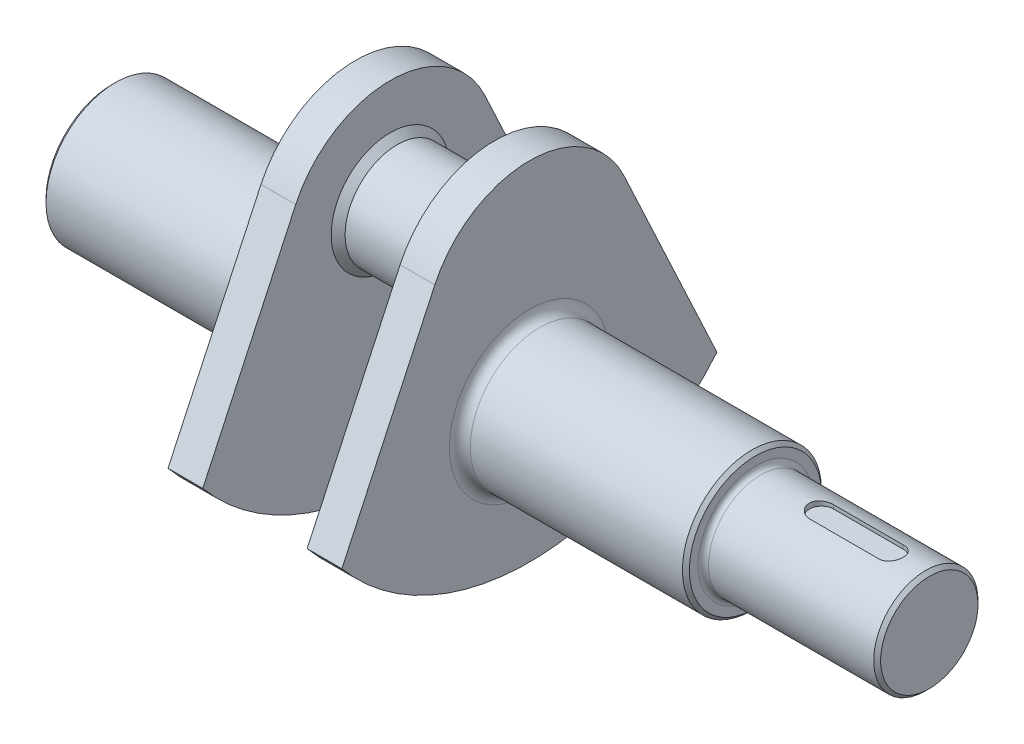
ISO-10303-21;
HEADER;
FILE_DESCRIPTION(('STEP AP214'),'2;1');
FILE_NAME('part.step','',(''),(''),'','','');
FILE_SCHEMA(('AUTOMOTIVE_DESIGN { 1 0 10303 214 1 1 1 1 }'));
ENDSEC;
DATA;
#1=APPLICATION_CONTEXT('core data for automotive mechanical design processes');
#2=APPLICATION_PROTOCOL_DEFINITION('international standard','automotive_design',2000,#1);
#3=PRODUCT_CONTEXT('',#1,'mechanical');
#4=PRODUCT('Part','Part','',(#3));
#5=PRODUCT_RELATED_PRODUCT_CATEGORY('part','',(#4));
#6=PRODUCT_DEFINITION_FORMATION('','',#4);
#7=PRODUCT_DEFINITION_CONTEXT('part definition',#1,'design');
#8=PRODUCT_DEFINITION('design','',#6,#7);
#9=PRODUCT_DEFINITION_SHAPE('','',#8);
#10=(LENGTH_UNIT() NAMED_UNIT(*) SI_UNIT(.MILLI.,.METRE.));
#11=(NAMED_UNIT(*) PLANE_ANGLE_UNIT() SI_UNIT($,.RADIAN.));
#12=(NAMED_UNIT(*) SI_UNIT($,.STERADIAN.) SOLID_ANGLE_UNIT());
#13=UNCERTAINTY_MEASURE_WITH_UNIT(LENGTH_MEASURE(1.E-05),#10,'distance_accuracy_value','');
#14=(GEOMETRIC_REPRESENTATION_CONTEXT(3) GLOBAL_UNCERTAINTY_ASSIGNED_CONTEXT((#13)) GLOBAL_UNIT_ASSIGNED_CONTEXT((#10,
#11,#12)) REPRESENTATION_CONTEXT('',''));
#15=CARTESIAN_POINT('',(0.,0.,0.));
#16=DIRECTION('',(0.,0.,1.));
#17=DIRECTION('',(1.,0.,0.));
#18=AXIS2_PLACEMENT_3D('',#15,#16,#17);
#19=CARTESIAN_POINT('',(190.,0.,0.));
#20=DIRECTION('',(1.,0.,0.));
#21=DIRECTION('',(0.,0.,1.));
#22=AXIS2_PLACEMENT_3D('',#19,#20,#21);
#23=CYLINDRICAL_SURFACE('',#22,20.);
#24=CARTESIAN_POINT('',(184.,0.,0.));
#25=DIRECTION('',(1.,0.,0.));
#26=DIRECTION('',(0.,0.,-1.));
#27=AXIS2_PLACEMENT_3D('',#24,#25,#26);
#28=CIRCLE('',#27,20.);
#29=CARTESIAN_POINT('',(184.,0.,-20.));
#30=VERTEX_POINT('',#29);
#31=EDGE_CURVE('E319',#30,#30,#28,.F.);
#32=ORIENTED_EDGE('',*,*,#31,.T.);
#33=EDGE_LOOP('',(#32));
#34=FACE_BOUND('',#33,.T.);
#35=CARTESIAN_POINT('',(123.,0.,0.));
#36=DIRECTION('',(-1.,0.,0.));
#37=DIRECTION('',(0.,0.,1.));
#38=AXIS2_PLACEMENT_3D('',#35,#36,#37);
#39=CIRCLE('',#38,20.);
#40=CARTESIAN_POINT('',(123.,0.,20.));
#41=VERTEX_POINT('',#40);
#42=EDGE_CURVE('E220',#41,#41,#39,.T.);
#43=ORIENTED_EDGE('',*,*,#42,.F.);
#44=EDGE_LOOP('',(#43));
#45=FACE_BOUND('',#44,.T.);
#46=ADVANCED_FACE('F45',(#34,#45),#23,.T.);
#47=CARTESIAN_POINT('',(110.,0.,0.));
#48=DIRECTION('',(-1.,0.,0.));
#49=DIRECTION('',(0.,0.,-1.));
#50=AXIS2_PLACEMENT_3D('',#47,#48,#49);
#51=PLANE('',#50);
#52=CARTESIAN_POINT('',(110.,30.,0.));
#53=DIRECTION('',(-1.,0.,0.));
#54=DIRECTION('',(0.,0.,1.));
#55=AXIS2_PLACEMENT_3D('',#52,#53,#54);
#56=CIRCLE('',#55,17.);
#57=CARTESIAN_POINT('',(110.,30.,17.));
#58=VERTEX_POINT('',#57);
#59=EDGE_CURVE('E283',#58,#58,#56,.F.);
#60=ORIENTED_EDGE('',*,*,#59,.T.);
#61=EDGE_LOOP('',(#60));
#62=FACE_BOUND('',#61,.T.);
#63=DIRECTION('',(0.,0.90630778703665,-0.4226182617407));
#64=VECTOR('',#63,1.);
#65=CARTESIAN_POINT('',(110.,18.0367337069229,38.6799002578842));
#66=LINE('',#65,#64);
#67=CARTESIAN_POINT('',(110.,-14.6413895114318,53.9179593687357));
#68=VERTEX_POINT('',#67);
#69=CARTESIAN_POINT('',(110.,42.678547852221,27.1892336110995));
#70=VERTEX_POINT('',#69);
#71=EDGE_CURVE('E186',#68,#70,#66,.T.);
#72=ORIENTED_EDGE('',*,*,#71,.T.);
#73=CARTESIAN_POINT('',(110.,30.,0.));
#74=DIRECTION('',(1.,0.,0.));
#75=DIRECTION('',(0.,0.,-1.));
#76=AXIS2_PLACEMENT_3D('',#73,#74,#75);
#77=CIRCLE('',#76,30.);
#78=CARTESIAN_POINT('',(110.,42.678547852221,-27.1892336110995));
#79=VERTEX_POINT('',#78);
#80=EDGE_CURVE('E176',#79,#70,#77,.T.);
#81=ORIENTED_EDGE('',*,*,#80,.F.);
#82=DIRECTION('',(0.,0.90630778703665,0.4226182617407));
#83=VECTOR('',#82,1.);
#84=CARTESIAN_POINT('',(110.,18.0367337069229,-38.6799002578842));
#85=LINE('',#84,#83);
#86=CARTESIAN_POINT('',(110.,-14.6413895114318,-53.9179593687357));
#87=VERTEX_POINT('',#86);
#88=EDGE_CURVE('E179',#87,#79,#85,.T.);
#89=ORIENTED_EDGE('',*,*,#88,.F.);
#90=CARTESIAN_POINT('',(110.,30.,0.));
#91=DIRECTION('',(1.,0.,0.));
#92=DIRECTION('',(0.,0.,-1.));
#93=AXIS2_PLACEMENT_3D('',#90,#91,#92);
#94=CIRCLE('',#93,70.);
#95=EDGE_CURVE('E183',#68,#87,#94,.T.);
#96=ORIENTED_EDGE('',*,*,#95,.F.);
#97=EDGE_LOOP('',(#72,#81,#89,#96));
#98=FACE_BOUND('',#97,.T.);
#99=ADVANCED_FACE('F367',(#62,#98),#51,.T.);
#100=CARTESIAN_POINT('',(70.,0.,0.));
#101=DIRECTION('',(-1.,0.,0.));
#102=DIRECTION('',(0.,0.,1.));
#103=AXIS2_PLACEMENT_3D('',#100,#101,#102);
#104=PLANE('',#103);
#105=CARTESIAN_POINT('',(70.,0.,0.));
#106=DIRECTION('',(-1.,0.,0.));
#107=DIRECTION('',(0.,0.,1.));
#108=AXIS2_PLACEMENT_3D('',#105,#106,#107);
#109=CIRCLE('',#108,23.);
#110=CARTESIAN_POINT('',(70.,0.,23.));
#111=VERTEX_POINT('',#110);
#112=EDGE_CURVE('E258',#111,#111,#109,.T.);
#113=ORIENTED_EDGE('',*,*,#112,.F.);
#114=EDGE_LOOP('',(#113));
#115=FACE_BOUND('',#114,.T.);
#116=DIRECTION('',(0.,0.90630778703665,-0.4226182617407));
#117=VECTOR('',#116,1.);
#118=CARTESIAN_POINT('',(70.,18.0367337069229,38.6799002578842));
#119=LINE('',#118,#117);
#120=CARTESIAN_POINT('',(70.,-14.6413895114318,53.9179593687357));
#121=VERTEX_POINT('',#120);
#122=CARTESIAN_POINT('',(70.,42.678547852221,27.1892336110995));
#123=VERTEX_POINT('',#122);
#124=EDGE_CURVE('E244',#121,#123,#119,.T.);
#125=ORIENTED_EDGE('',*,*,#124,.T.);
#126=CARTESIAN_POINT('',(70.,30.,0.));
#127=DIRECTION('',(-1.,0.,0.));
#128=DIRECTION('',(0.,0.,1.));
#129=AXIS2_PLACEMENT_3D('',#126,#127,#128);
#130=CIRCLE('',#129,30.);
#131=CARTESIAN_POINT('',(70.,42.678547852221,-27.1892336110995));
#132=VERTEX_POINT('',#131);
#133=EDGE_CURVE('E224',#123,#132,#130,.T.);
#134=ORIENTED_EDGE('',*,*,#133,.T.);
#135=DIRECTION('',(0.,0.90630778703665,0.4226182617407));
#136=VECTOR('',#135,1.);
#137=CARTESIAN_POINT('',(70.,18.0367337069229,-38.6799002578842));
#138=LINE('',#137,#136);
#139=CARTESIAN_POINT('',(70.,-14.6413895114318,-53.9179593687357));
#140=VERTEX_POINT('',#139);
#141=EDGE_CURVE('E229',#140,#132,#138,.T.);
#142=ORIENTED_EDGE('',*,*,#141,.F.);
#143=CARTESIAN_POINT('',(70.,30.,0.));
#144=DIRECTION('',(-1.,0.,0.));
#145=DIRECTION('',(0.,0.,1.));
#146=AXIS2_PLACEMENT_3D('',#143,#144,#145);
#147=CIRCLE('',#146,70.);
#148=EDGE_CURVE('E248',#140,#121,#147,.T.);
#149=ORIENTED_EDGE('',*,*,#148,.T.);
#150=EDGE_LOOP('',(#125,#134,#142,#149));
#151=FACE_BOUND('',#150,.T.);
#152=ADVANCED_FACE('F373',(#115,#151),#104,.T.);
#153=CARTESIAN_POINT('',(67.,0.,0.));
#154=DIRECTION('',(-1.,0.,0.));
#155=DIRECTION('',(0.,0.,1.));
#156=AXIS2_PLACEMENT_3D('',#153,#154,#155);
#157=TOROIDAL_SURFACE('',#156,23.,3.);
#158=ORIENTED_EDGE('',*,*,#112,.T.);
#159=EDGE_LOOP('',(#158));
#160=FACE_BOUND('',#159,.T.);
#161=CARTESIAN_POINT('',(67.,0.,0.));
#162=DIRECTION('',(-1.,0.,0.));
#163=DIRECTION('',(0.,0.,1.));
#164=AXIS2_PLACEMENT_3D('',#161,#162,#163);
#165=CIRCLE('',#164,20.);
#166=CARTESIAN_POINT('',(67.,0.,20.));
#167=VERTEX_POINT('',#166);
#168=EDGE_CURVE('E279',#167,#167,#165,.T.);
#169=ORIENTED_EDGE('',*,*,#168,.F.);
#170=EDGE_LOOP('',(#169));
#171=FACE_BOUND('',#170,.T.);
#172=ADVANCED_FACE('F410',(#160,#171),#157,.F.);
#173=CARTESIAN_POINT('',(0.,0.,0.));
#174=DIRECTION('',(-1.,0.,0.));
#175=DIRECTION('',(0.,0.,1.));
#176=AXIS2_PLACEMENT_3D('',#173,#174,#175);
#177=CYLINDRICAL_SURFACE('',#176,20.);
#178=ORIENTED_EDGE('',*,*,#168,.T.);
#179=EDGE_LOOP('',(#178));
#180=FACE_BOUND('',#179,.T.);
#181=CARTESIAN_POINT('',(1.,0.,0.));
#182=DIRECTION('',(-1.,0.,0.));
#183=DIRECTION('',(0.,0.,1.));
#184=AXIS2_PLACEMENT_3D('',#181,#182,#183);
#185=CIRCLE('',#184,20.);
#186=CARTESIAN_POINT('',(1.,0.,20.));
#187=VERTEX_POINT('',#186);
#188=EDGE_CURVE('E275',#187,#187,#185,.T.);
#189=ORIENTED_EDGE('',*,*,#188,.F.);
#190=EDGE_LOOP('',(#189));
#191=FACE_BOUND('',#190,.T.);
#192=ADVANCED_FACE('F421',(#180,#191),#177,.T.);
#193=CARTESIAN_POINT('',(0.,0.,0.));
#194=DIRECTION('',(1.,0.,0.));
#195=DIRECTION('',(0.,0.,-1.));
#196=AXIS2_PLACEMENT_3D('',#193,#194,#195);
#197=CONICAL_SURFACE('',#196,19.,0.785398163397449);
#198=ORIENTED_EDGE('',*,*,#188,.T.);
#199=EDGE_LOOP('',(#198));
#200=FACE_BOUND('',#199,.T.);
#201=CARTESIAN_POINT('',(0.,0.,0.));
#202=DIRECTION('',(-1.,0.,0.));
#203=DIRECTION('',(0.,0.,1.));
#204=AXIS2_PLACEMENT_3D('',#201,#202,#203);
#205=CIRCLE('',#204,19.);
#206=CARTESIAN_POINT('',(0.,0.,19.));
#207=VERTEX_POINT('',#206);
#208=EDGE_CURVE('E271',#207,#207,#205,.T.);
#209=ORIENTED_EDGE('',*,*,#208,.F.);
#210=EDGE_LOOP('',(#209));
#211=FACE_BOUND('',#210,.T.);
#212=ADVANCED_FACE('F417',(#200,#211),#197,.T.);
#213=CARTESIAN_POINT('',(0.,0.,0.));
#214=DIRECTION('',(-1.,0.,0.));
#215=DIRECTION('',(0.,0.,1.));
#216=AXIS2_PLACEMENT_3D('',#213,#214,#215);
#217=PLANE('',#216);
#218=ORIENTED_EDGE('',*,*,#208,.T.);
#219=EDGE_LOOP('',(#218));
#220=FACE_BOUND('',#219,.T.);
#221=ADVANCED_FACE('F406',(#220),#217,.T.);
#222=CARTESIAN_POINT('',(80.,30.,0.));
#223=DIRECTION('',(-1.,0.,0.));
#224=DIRECTION('',(0.,0.,1.));
#225=AXIS2_PLACEMENT_3D('',#222,#223,#224);
#226=CYLINDRICAL_SURFACE('',#225,30.);
#227=ORIENTED_EDGE('',*,*,#133,.F.);
#228=DIRECTION('',(-1.,0.,0.));
#229=VECTOR('',#228,1.);
#230=CARTESIAN_POINT('',(80.,42.678547852221,27.1892336110995));
#231=LINE('',#230,#229);
#232=CARTESIAN_POINT('',(80.,42.678547852221,27.1892336110995));
#233=VERTEX_POINT('',#232);
#234=EDGE_CURVE('E240',#233,#123,#231,.T.);
#235=ORIENTED_EDGE('',*,*,#234,.F.);
#236=CARTESIAN_POINT('',(80.,30.,0.));
#237=DIRECTION('',(-1.,0.,0.));
#238=DIRECTION('',(0.,0.,1.));
#239=AXIS2_PLACEMENT_3D('',#236,#237,#238);
#240=CIRCLE('',#239,30.);
#241=CARTESIAN_POINT('',(80.,42.678547852221,-27.1892336110995));
#242=VERTEX_POINT('',#241);
#243=EDGE_CURVE('E225',#233,#242,#240,.T.);
#244=ORIENTED_EDGE('',*,*,#243,.T.);
#245=DIRECTION('',(-1.,0.,0.));
#246=VECTOR('',#245,1.);
#247=CARTESIAN_POINT('',(80.,42.678547852221,-27.1892336110995));
#248=LINE('',#247,#246);
#249=EDGE_CURVE('E255',#242,#132,#248,.T.);
#250=ORIENTED_EDGE('',*,*,#249,.T.);
#251=EDGE_LOOP('',(#227,#235,#244,#250));
#252=FACE_BOUND('',#251,.T.);
#253=ADVANCED_FACE('F395',(#252),#226,.T.);
#254=CARTESIAN_POINT('',(80.,18.0367337069229,-38.6799002578842));
#255=DIRECTION('',(0.,-0.4226182617407,0.90630778703665));
#256=DIRECTION('',(0.,-0.90630778703665,-0.4226182617407));
#257=AXIS2_PLACEMENT_3D('',#254,#255,#256);
#258=PLANE('',#257);
#259=ORIENTED_EDGE('',*,*,#141,.T.);
#260=ORIENTED_EDGE('',*,*,#249,.F.);
#261=DIRECTION('',(0.,0.90630778703665,0.4226182617407));
#262=VECTOR('',#261,1.);
#263=CARTESIAN_POINT('',(80.,18.0367337069229,-38.6799002578842));
#264=LINE('',#263,#262);
#265=CARTESIAN_POINT('',(80.,-14.6413895114318,-53.9179593687357));
#266=VERTEX_POINT('',#265);
#267=EDGE_CURVE('E236',#266,#242,#264,.T.);
#268=ORIENTED_EDGE('',*,*,#267,.F.);
#269=DIRECTION('',(-1.,0.,0.));
#270=VECTOR('',#269,1.);
#271=CARTESIAN_POINT('',(80.,-14.6413895114318,-53.9179593687357));
#272=LINE('',#271,#270);
#273=EDGE_CURVE('E259',#266,#140,#272,.T.);
#274=ORIENTED_EDGE('',*,*,#273,.T.);
#275=EDGE_LOOP('',(#259,#260,#268,#274));
#276=FACE_BOUND('',#275,.T.);
#277=ADVANCED_FACE('F391',(#276),#258,.F.);
#278=CARTESIAN_POINT('',(80.,30.,0.));
#279=DIRECTION('',(-1.,0.,0.));
#280=DIRECTION('',(0.,0.,1.));
#281=AXIS2_PLACEMENT_3D('',#278,#279,#280);
#282=CYLINDRICAL_SURFACE('',#281,70.);
#283=ORIENTED_EDGE('',*,*,#148,.F.);
#284=ORIENTED_EDGE('',*,*,#273,.F.);
#285=CARTESIAN_POINT('',(80.,30.,0.));
#286=DIRECTION('',(-1.,0.,0.));
#287=DIRECTION('',(0.,0.,1.));
#288=AXIS2_PLACEMENT_3D('',#285,#286,#287);
#289=CIRCLE('',#288,70.);
#290=CARTESIAN_POINT('',(80.,-14.6413895114317,53.9179593687357));
#291=VERTEX_POINT('',#290);
#292=EDGE_CURVE('E232',#266,#291,#289,.T.);
#293=ORIENTED_EDGE('',*,*,#292,.T.);
#294=DIRECTION('',(-1.,0.,0.));
#295=VECTOR('',#294,1.);
#296=CARTESIAN_POINT('',(80.,-14.6413895114318,53.9179593687357));
#297=LINE('',#296,#295);
#298=EDGE_CURVE('E262',#291,#121,#297,.T.);
#299=ORIENTED_EDGE('',*,*,#298,.T.);
#300=EDGE_LOOP('',(#283,#284,#293,#299));
#301=FACE_BOUND('',#300,.T.);
#302=ADVANCED_FACE('F394',(#301),#282,.T.);
#303=CARTESIAN_POINT('',(80.,18.0367337069229,38.6799002578842));
#304=DIRECTION('',(0.,0.4226182617407,0.90630778703665));
#305=DIRECTION('',(0.,-0.90630778703665,0.4226182617407));
#306=AXIS2_PLACEMENT_3D('',#303,#304,#305);
#307=PLANE('',#306);
#308=ORIENTED_EDGE('',*,*,#124,.F.);
#309=ORIENTED_EDGE('',*,*,#298,.F.);
#310=DIRECTION('',(0.,0.90630778703665,-0.4226182617407));
#311=VECTOR('',#310,1.);
#312=CARTESIAN_POINT('',(80.,18.0367337069229,38.6799002578842));
#313=LINE('',#312,#311);
#314=EDGE_CURVE('E228',#291,#233,#313,.T.);
#315=ORIENTED_EDGE('',*,*,#314,.T.);
#316=ORIENTED_EDGE('',*,*,#234,.T.);
#317=EDGE_LOOP('',(#308,#309,#315,#316));
#318=FACE_BOUND('',#317,.T.);
#319=ADVANCED_FACE('F399',(#318),#307,.T.);
#320=CARTESIAN_POINT('',(80.,0.,0.));
#321=DIRECTION('',(1.,0.,0.));
#322=DIRECTION('',(0.,0.,-1.));
#323=AXIS2_PLACEMENT_3D('',#320,#321,#322);
#324=PLANE('',#323);
#325=CARTESIAN_POINT('',(80.,30.,0.));
#326=DIRECTION('',(1.,0.,0.));
#327=DIRECTION('',(0.,0.,-1.));
#328=AXIS2_PLACEMENT_3D('',#325,#326,#327);
#329=CIRCLE('',#328,16.9999999999999);
#330=CARTESIAN_POINT('',(80.,30.,-16.9999999999999));
#331=VERTEX_POINT('',#330);
#332=EDGE_CURVE('E295',#331,#331,#329,.F.);
#333=ORIENTED_EDGE('',*,*,#332,.T.);
#334=EDGE_LOOP('',(#333));
#335=FACE_BOUND('',#334,.T.);
#336=ORIENTED_EDGE('',*,*,#267,.T.);
#337=ORIENTED_EDGE('',*,*,#243,.F.);
#338=ORIENTED_EDGE('',*,*,#314,.F.);
#339=ORIENTED_EDGE('',*,*,#292,.F.);
#340=EDGE_LOOP('',(#336,#337,#338,#339));
#341=FACE_BOUND('',#340,.T.);
#342=ADVANCED_FACE('F389',(#335,#341),#324,.T.);
#343=CARTESIAN_POINT('',(110.,30.,0.));
#344=DIRECTION('',(-1.,0.,0.));
#345=DIRECTION('',(0.,0.,1.));
#346=AXIS2_PLACEMENT_3D('',#343,#344,#345);
#347=CYLINDRICAL_SURFACE('',#346,15.);
#348=CARTESIAN_POINT('',(108.,30.,0.));
#349=DIRECTION('',(-1.,0.,0.));
#350=DIRECTION('',(0.,0.,1.));
#351=AXIS2_PLACEMENT_3D('',#348,#349,#350);
#352=CIRCLE('',#351,15.);
#353=CARTESIAN_POINT('',(108.,30.,15.));
#354=VERTEX_POINT('',#353);
#355=EDGE_CURVE('E291',#354,#354,#352,.T.);
#356=ORIENTED_EDGE('',*,*,#355,.T.);
#357=EDGE_LOOP('',(#356));
#358=FACE_BOUND('',#357,.T.);
#359=CARTESIAN_POINT('',(82.,30.,0.));
#360=DIRECTION('',(1.,0.,0.));
#361=DIRECTION('',(0.,0.,-1.));
#362=AXIS2_PLACEMENT_3D('',#359,#360,#361);
#363=CIRCLE('',#362,15.);
#364=CARTESIAN_POINT('',(82.,30.,-15.));
#365=VERTEX_POINT('',#364);
#366=EDGE_CURVE('E287',#365,#365,#363,.T.);
#367=ORIENTED_EDGE('',*,*,#366,.T.);
#368=EDGE_LOOP('',(#367));
#369=FACE_BOUND('',#368,.T.);
#370=ADVANCED_FACE('F385',(#358,#369),#347,.T.);
#371=CARTESIAN_POINT('',(110.,30.,0.));
#372=DIRECTION('',(1.,0.,0.));
#373=DIRECTION('',(0.,0.,-1.));
#374=AXIS2_PLACEMENT_3D('',#371,#372,#373);
#375=CYLINDRICAL_SURFACE('',#374,30.);
#376=CARTESIAN_POINT('',(120.,30.,0.));
#377=DIRECTION('',(1.,0.,0.));
#378=DIRECTION('',(0.,0.,-1.));
#379=AXIS2_PLACEMENT_3D('',#376,#377,#378);
#380=CIRCLE('',#379,30.);
#381=CARTESIAN_POINT('',(120.,42.678547852221,-27.1892336110995));
#382=VERTEX_POINT('',#381);
#383=CARTESIAN_POINT('',(120.,42.678547852221,27.1892336110995));
#384=VERTEX_POINT('',#383);
#385=EDGE_CURVE('E169',#382,#384,#380,.T.);
#386=ORIENTED_EDGE('',*,*,#385,.F.);
#387=DIRECTION('',(1.,0.,0.));
#388=VECTOR('',#387,1.);
#389=CARTESIAN_POINT('',(110.,42.678547852221,-27.1892336110995));
#390=LINE('',#389,#388);
#391=EDGE_CURVE('E190',#79,#382,#390,.T.);
#392=ORIENTED_EDGE('',*,*,#391,.F.);
#393=ORIENTED_EDGE('',*,*,#80,.T.);
#394=DIRECTION('',(1.,0.,0.));
#395=VECTOR('',#394,1.);
#396=CARTESIAN_POINT('',(110.,42.678547852221,27.1892336110995));
#397=LINE('',#396,#395);
#398=EDGE_CURVE('E205',#70,#384,#397,.T.);
#399=ORIENTED_EDGE('',*,*,#398,.T.);
#400=EDGE_LOOP('',(#386,#392,#393,#399));
#401=FACE_BOUND('',#400,.T.);
#402=ADVANCED_FACE('F388',(#401),#375,.T.);
#403=CARTESIAN_POINT('',(110.,18.0367337069229,38.6799002578842));
#404=DIRECTION('',(0.,-0.4226182617407,-0.90630778703665));
#405=DIRECTION('',(0.,0.90630778703665,-0.4226182617407));
#406=AXIS2_PLACEMENT_3D('',#403,#404,#405);
#407=PLANE('',#406);
#408=DIRECTION('',(0.,0.90630778703665,-0.4226182617407));
#409=VECTOR('',#408,1.);
#410=CARTESIAN_POINT('',(120.,18.0367337069229,38.6799002578842));
#411=LINE('',#410,#409);
#412=CARTESIAN_POINT('',(120.,-14.6413895114318,53.9179593687357));
#413=VERTEX_POINT('',#412);
#414=EDGE_CURVE('E180',#413,#384,#411,.T.);
#415=ORIENTED_EDGE('',*,*,#414,.T.);
#416=ORIENTED_EDGE('',*,*,#398,.F.);
#417=ORIENTED_EDGE('',*,*,#71,.F.);
#418=DIRECTION('',(1.,0.,0.));
#419=VECTOR('',#418,1.);
#420=CARTESIAN_POINT('',(110.,-14.6413895114318,53.9179593687357));
#421=LINE('',#420,#419);
#422=EDGE_CURVE('E209',#68,#413,#421,.T.);
#423=ORIENTED_EDGE('',*,*,#422,.T.);
#424=EDGE_LOOP('',(#415,#416,#417,#423));
#425=FACE_BOUND('',#424,.T.);
#426=ADVANCED_FACE('F465',(#425),#407,.F.);
#427=CARTESIAN_POINT('',(110.,30.,0.));
#428=DIRECTION('',(1.,0.,0.));
#429=DIRECTION('',(0.,0.,-1.));
#430=AXIS2_PLACEMENT_3D('',#427,#428,#429);
#431=CYLINDRICAL_SURFACE('',#430,70.);
#432=CARTESIAN_POINT('',(120.,30.,0.));
#433=DIRECTION('',(1.,0.,0.));
#434=DIRECTION('',(0.,0.,-1.));
#435=AXIS2_PLACEMENT_3D('',#432,#433,#434);
#436=CIRCLE('',#435,70.);
#437=CARTESIAN_POINT('',(120.,-14.6413895114318,-53.9179593687357));
#438=VERTEX_POINT('',#437);
#439=EDGE_CURVE('E198',#413,#438,#436,.T.);
#440=ORIENTED_EDGE('',*,*,#439,.F.);
#441=ORIENTED_EDGE('',*,*,#422,.F.);
#442=ORIENTED_EDGE('',*,*,#95,.T.);
#443=DIRECTION('',(1.,0.,0.));
#444=VECTOR('',#443,1.);
#445=CARTESIAN_POINT('',(110.,-14.6413895114318,-53.9179593687357));
#446=LINE('',#445,#444);
#447=EDGE_CURVE('E70',#87,#438,#446,.T.);
#448=ORIENTED_EDGE('',*,*,#447,.T.);
#449=EDGE_LOOP('',(#440,#441,#442,#448));
#450=FACE_BOUND('',#449,.T.);
#451=ADVANCED_FACE('F468',(#450),#431,.T.);
#452=CARTESIAN_POINT('',(110.,18.0367337069229,-38.6799002578842));
#453=DIRECTION('',(0.,0.4226182617407,-0.90630778703665));
#454=DIRECTION('',(0.,0.90630778703665,0.4226182617407));
#455=AXIS2_PLACEMENT_3D('',#452,#453,#454);
#456=PLANE('',#455);
#457=DIRECTION('',(0.,0.90630778703665,0.4226182617407));
#458=VECTOR('',#457,1.);
#459=CARTESIAN_POINT('',(120.,18.0367337069229,-38.6799002578842));
#460=LINE('',#459,#458);
#461=EDGE_CURVE('E194',#438,#382,#460,.T.);
#462=ORIENTED_EDGE('',*,*,#461,.F.);
#463=ORIENTED_EDGE('',*,*,#447,.F.);
#464=ORIENTED_EDGE('',*,*,#88,.T.);
#465=ORIENTED_EDGE('',*,*,#391,.T.);
#466=EDGE_LOOP('',(#462,#463,#464,#465));
#467=FACE_BOUND('',#466,.T.);
#468=ADVANCED_FACE('F383',(#467),#456,.T.);
#469=CARTESIAN_POINT('',(123.,0.,0.));
#470=DIRECTION('',(1.,0.,0.));
#471=DIRECTION('',(0.,0.,1.));
#472=AXIS2_PLACEMENT_3D('',#469,#470,#471);
#473=TOROIDAL_SURFACE('',#472,23.,3.);
#474=CARTESIAN_POINT('',(120.,0.,0.));
#475=DIRECTION('',(-1.,0.,0.));
#476=DIRECTION('',(0.,0.,1.));
#477=AXIS2_PLACEMENT_3D('',#474,#475,#476);
#478=CIRCLE('',#477,23.);
#479=CARTESIAN_POINT('',(120.,0.,23.));
#480=VERTEX_POINT('',#479);
#481=EDGE_CURVE('E208',#480,#480,#478,.T.);
#482=ORIENTED_EDGE('',*,*,#481,.F.);
#483=EDGE_LOOP('',(#482));
#484=FACE_BOUND('',#483,.T.);
#485=ORIENTED_EDGE('',*,*,#42,.T.);
#486=EDGE_LOOP('',(#485));
#487=FACE_BOUND('',#486,.T.);
#488=ADVANCED_FACE('F379',(#484,#487),#473,.F.);
#489=CARTESIAN_POINT('',(120.,0.,0.));
#490=DIRECTION('',(1.,0.,0.));
#491=DIRECTION('',(0.,0.,1.));
#492=AXIS2_PLACEMENT_3D('',#489,#490,#491);
#493=PLANE('',#492);
#494=ORIENTED_EDGE('',*,*,#481,.T.);
#495=EDGE_LOOP('',(#494));
#496=FACE_BOUND('',#495,.T.);
#497=ORIENTED_EDGE('',*,*,#461,.T.);
#498=ORIENTED_EDGE('',*,*,#385,.T.);
#499=ORIENTED_EDGE('',*,*,#414,.F.);
#500=ORIENTED_EDGE('',*,*,#439,.T.);
#501=EDGE_LOOP('',(#497,#498,#499,#500));
#502=FACE_BOUND('',#501,.T.);
#503=ADVANCED_FACE('F382',(#496,#502),#493,.T.);
#504=CARTESIAN_POINT('',(110.,30.,0.));
#505=DIRECTION('',(1.,0.,0.));
#506=DIRECTION('',(0.,0.,-1.));
#507=AXIS2_PLACEMENT_3D('',#504,#505,#506);
#508=CONICAL_SURFACE('',#507,17.,0.785398163397452);
#509=ORIENTED_EDGE('',*,*,#355,.F.);
#510=EDGE_LOOP('',(#509));
#511=FACE_BOUND('',#510,.T.);
#512=ORIENTED_EDGE('',*,*,#59,.F.);
#513=EDGE_LOOP('',(#512));
#514=FACE_BOUND('',#513,.T.);
#515=ADVANCED_FACE('F430',(#511,#514),#508,.T.);
#516=CARTESIAN_POINT('',(82.,30.,0.));
#517=DIRECTION('',(-1.,0.,0.));
#518=DIRECTION('',(0.,0.,1.));
#519=AXIS2_PLACEMENT_3D('',#516,#517,#518);
#520=CONICAL_SURFACE('',#519,15.,0.785398163397438);
#521=ORIENTED_EDGE('',*,*,#332,.F.);
#522=EDGE_LOOP('',(#521));
#523=FACE_BOUND('',#522,.T.);
#524=ORIENTED_EDGE('',*,*,#366,.F.);
#525=EDGE_LOOP('',(#524));
#526=FACE_BOUND('',#525,.T.);
#527=ADVANCED_FACE('F436',(#523,#526),#520,.T.);
#528=CARTESIAN_POINT('',(185.,0.,0.));
#529=DIRECTION('',(1.,0.,0.));
#530=DIRECTION('',(0.,0.,-1.));
#531=AXIS2_PLACEMENT_3D('',#528,#529,#530);
#532=PLANE('',#531);
#533=CARTESIAN_POINT('',(185.,0.,0.));
#534=DIRECTION('',(1.,0.,0.));
#535=DIRECTION('',(0.,0.,-1.));
#536=AXIS2_PLACEMENT_3D('',#533,#534,#535);
#537=CIRCLE('',#536,19.);
#538=CARTESIAN_POINT('',(185.,0.,-19.));
#539=VERTEX_POINT('',#538);
#540=EDGE_CURVE('E315',#539,#539,#537,.T.);
#541=ORIENTED_EDGE('',*,*,#540,.T.);
#542=EDGE_LOOP('',(#541));
#543=FACE_BOUND('',#542,.T.);
#544=CARTESIAN_POINT('',(185.,0.,0.));
#545=DIRECTION('',(1.,0.,0.));
#546=DIRECTION('',(0.,0.,-1.));
#547=AXIS2_PLACEMENT_3D('',#544,#545,#546);
#548=CIRCLE('',#547,16.5);
#549=CARTESIAN_POINT('',(185.,0.,-16.5));
#550=VERTEX_POINT('',#549);
#551=EDGE_CURVE('E311',#550,#550,#548,.F.);
#552=ORIENTED_EDGE('',*,*,#551,.T.);
#553=EDGE_LOOP('',(#552));
#554=FACE_BOUND('',#553,.T.);
#555=ADVANCED_FACE('F364',(#543,#554),#532,.T.);
#556=CARTESIAN_POINT('',(235.,0.,0.));
#557=DIRECTION('',(-1.,0.,0.));
#558=DIRECTION('',(0.,0.,1.));
#559=AXIS2_PLACEMENT_3D('',#556,#557,#558);
#560=CYLINDRICAL_SURFACE('',#559,15.);
#561=DIRECTION('',(-1.,0.,0.));
#562=VECTOR('',#561,1.);
#563=CARTESIAN_POINT('',(235.,14.5859521458148,3.5));
#564=LINE('',#563,#562);
#565=CARTESIAN_POINT('',(224.,14.5859521458148,3.5));
#566=VERTEX_POINT('',#565);
#567=CARTESIAN_POINT('',(204.,14.5859521458148,3.5));
#568=VERTEX_POINT('',#567);
#569=EDGE_CURVE('E11',#566,#568,#564,.T.);
#570=ORIENTED_EDGE('',*,*,#569,.T.);
#571=CARTESIAN_POINT('',(204.,14.5859521458148,3.5));
#572=CARTESIAN_POINT('',(203.90299300161,14.5859421427493,3.50001098449828));
#573=CARTESIAN_POINT('',(203.805992360835,14.5869196724103,3.4959671414725));
#574=CARTESIAN_POINT('',(203.612712184711,14.590775651507,3.47985507535717));
#575=CARTESIAN_POINT('',(203.516432541902,14.5936538117244,3.46778807314716));
#576=CARTESIAN_POINT('',(203.325446071953,14.6012300751875,3.43574398529353));
#577=CARTESIAN_POINT('',(203.230736710124,14.6059248699511,3.41578127797057));
#578=CARTESIAN_POINT('',(203.043408831538,14.6169869222721,3.36812809560663));
#579=CARTESIAN_POINT('',(202.950790336207,14.6233541969602,3.3404375414115));
#580=CARTESIAN_POINT('',(202.677043905043,14.6447008951947,3.24606757093601));
#581=CARTESIAN_POINT('',(202.499847810349,14.6619327373735,3.16805985507851));
#582=CARTESIAN_POINT('',(202.16110813051,14.7004448089945,2.98423929243028));
#583=CARTESIAN_POINT('',(201.99956783575,14.7217258866924,2.87842061787579));
#584=CARTESIAN_POINT('',(201.693557552577,14.7663931109474,2.63980745312909));
#585=CARTESIAN_POINT('',(201.549427454254,14.7898090771762,2.50658184202697));
#586=CARTESIAN_POINT('',(201.28533943885,14.8358492789609,2.21786171845335));
#587=CARTESIAN_POINT('',(201.165385336529,14.8584733891041,2.0623636982024));
#588=CARTESIAN_POINT('',(200.951681332091,14.9007084250488,1.73119672453191));
#589=CARTESIAN_POINT('',(200.858264317659,14.9202797924377,1.55530745410667));
#590=CARTESIAN_POINT('',(200.70245169925,14.9538625089062,1.18980124862644));
#591=CARTESIAN_POINT('',(200.6400505368,14.9678748541492,1.00018678030166));
#592=CARTESIAN_POINT('',(200.549120378715,14.9885500433699,0.616173224991133));
#593=CARTESIAN_POINT('',(200.520010286704,14.9953388235654,0.421918632898761));
#594=CARTESIAN_POINT('',(200.494668497593,15.0012395227913,0.031168020552773));
#595=CARTESIAN_POINT('',(200.498433283717,15.0003522629628,-0.165327757705068));
#596=CARTESIAN_POINT('',(200.538309557723,14.9910956750293,-0.550956893237223));
#597=CARTESIAN_POINT('',(200.573793546068,14.9828714990804,-0.740159139561288));
#598=CARTESIAN_POINT('',(200.675096538138,14.9600322528955,-1.10984488893197));
#599=CARTESIAN_POINT('',(200.74091677633,14.9454169225865,-1.29032803684348));
#600=CARTESIAN_POINT('',(200.901559191326,14.9112090063788,-1.63915837983499));
#601=CARTESIAN_POINT('',(200.996613032442,14.891576882551,-1.80739485663408));
#602=CARTESIAN_POINT('',(201.212844716927,14.8494785724435,-2.12574898098495));
#603=CARTESIAN_POINT('',(201.334025880502,14.8270120261216,-2.27586432195384));
#604=CARTESIAN_POINT('',(201.602461572676,14.7810806546351,-2.5574430797278));
#605=CARTESIAN_POINT('',(201.750262471457,14.7576047786936,-2.68838455782233));
#606=CARTESIAN_POINT('',(202.065974132894,14.7127850415719,-2.9237561983495));
#607=CARTESIAN_POINT('',(202.233890369665,14.6914417636609,-3.02817911988626));
#608=CARTESIAN_POINT('',(202.586209251305,14.6532641832194,-3.207863988369));
#609=CARTESIAN_POINT('',(202.770679628797,14.636449647026,-3.28299872056559));
#610=CARTESIAN_POINT('',(203.054926076654,14.6162291366116,-3.3714568024946));
#611=CARTESIAN_POINT('',(203.150915924742,14.6103230544348,-3.39690005180815));
#612=CARTESIAN_POINT('',(203.344788972752,14.6003411579581,-3.43955343397927));
#613=CARTESIAN_POINT('',(203.44267125845,14.5962644818446,-3.45676744379374));
#614=CARTESIAN_POINT('',(203.6172059877,14.590776016344,-3.47985101789181));
#615=CARTESIAN_POINT('',(203.693628718504,14.5889691858156,-3.48740952620271));
#616=CARTESIAN_POINT('',(203.846698075858,14.586556508166,-3.49748134958352));
#617=CARTESIAN_POINT('',(203.923344125767,14.5859486864736,-3.50000295968662));
#618=CARTESIAN_POINT('',(204.,14.5859521458148,-3.5));
#619=B_SPLINE_CURVE_WITH_KNOTS('',3,(#571,#572,#573,#574,#575,#576,#577,#578,#579,#580,#581,
#582,#583,#584,#585,#586,#587,#588,#589,#590,#591,#592,#593,#594,#595,#596,#597,#598,#599,#600,
#601,#602,#603,#604,#605,#606,#607,#608,#609,#610,#611,#612,#613,#614,#615,#616,#617,#618),
.UNSPECIFIED.,.F.,.F.,(4,2,2,2,2,2,2,2,2,2,2,2,2,2,2,2,2,2,2,2,2,2,2,4),(0.,0.290920806908684,
0.58179735469378,0.87214662830467,1.1624988759897,1.74267048309932,2.32296376176517,
2.91319936028677,3.50352802002667,4.10096424445484,4.69829336133234,5.28502883594113,
5.87170154554636,6.44701886588472,7.02235959958554,7.60238257188186,8.18247929581888,
8.77622447620056,9.37013160490157,9.96659039599139,10.2647254778977,10.5627199637331,
10.7930041430085,11.0229087642827),.UNSPECIFIED.);
#620=CARTESIAN_POINT('',(204.,14.5859521458148,-3.5));
#621=VERTEX_POINT('',#620);
#622=EDGE_CURVE('E323',#568,#621,#619,.T.);
#623=ORIENTED_EDGE('',*,*,#622,.T.);
#624=DIRECTION('',(-1.,0.,0.));
#625=VECTOR('',#624,1.);
#626=CARTESIAN_POINT('',(235.,14.5859521458148,-3.5));
#627=LINE('',#626,#625);
#628=CARTESIAN_POINT('',(224.,14.5859521458148,-3.5));
#629=VERTEX_POINT('',#628);
#630=EDGE_CURVE('E55',#621,#629,#627,.F.);
#631=ORIENTED_EDGE('',*,*,#630,.T.);
#632=CARTESIAN_POINT('',(224.,14.5859521458148,-3.5));
#633=CARTESIAN_POINT('',(224.09700699839,14.5859421427493,-3.50001098449828));
#634=CARTESIAN_POINT('',(224.194007639165,14.5869196724103,-3.49596714147249));
#635=CARTESIAN_POINT('',(224.387287815289,14.590775651507,-3.47985507535716));
#636=CARTESIAN_POINT('',(224.483567458098,14.5936538117244,-3.46778807314715));
#637=CARTESIAN_POINT('',(224.674553928047,14.6012300751875,-3.43574398529351));
#638=CARTESIAN_POINT('',(224.769263289876,14.6059248699511,-3.41578127797056));
#639=CARTESIAN_POINT('',(224.956591168462,14.6169869222721,-3.36812809560661));
#640=CARTESIAN_POINT('',(225.049209663793,14.6233541969602,-3.34043754141148));
#641=CARTESIAN_POINT('',(225.322956094957,14.6447008951947,-3.24606757093599));
#642=CARTESIAN_POINT('',(225.500152189652,14.6619327373735,-3.1680598550785));
#643=CARTESIAN_POINT('',(225.83889186949,14.7004448089945,-2.98423929243026));
#644=CARTESIAN_POINT('',(226.00043216425,14.7217258866924,-2.87842061787577));
#645=CARTESIAN_POINT('',(226.306442447423,14.7663931109474,-2.63980745312906));
#646=CARTESIAN_POINT('',(226.450572545746,14.7898090771762,-2.50658184202694));
#647=CARTESIAN_POINT('',(226.71466056115,14.8358492789609,-2.21786171845331));
#648=CARTESIAN_POINT('',(226.834614663471,14.8584733891041,-2.06236369820235));
#649=CARTESIAN_POINT('',(227.048318667909,14.9007084250488,-1.73119672453187));
#650=CARTESIAN_POINT('',(227.141735682341,14.9202797924377,-1.55530745410663));
#651=CARTESIAN_POINT('',(227.29754830075,14.9538625089062,-1.18980124862641));
#652=CARTESIAN_POINT('',(227.3599494632,14.9678748541492,-1.00018678030162));
#653=CARTESIAN_POINT('',(227.450879621285,14.9885500433699,-0.616173224991095));
#654=CARTESIAN_POINT('',(227.479989713296,14.9953388235654,-0.421918632898726));
#655=CARTESIAN_POINT('',(227.505331502407,15.0012395227913,-0.0311680205527437));
#656=CARTESIAN_POINT('',(227.501566716283,15.0003522629628,0.165327757705095));
#657=CARTESIAN_POINT('',(227.461690442277,14.9910956750293,0.550956893237245));
#658=CARTESIAN_POINT('',(227.426206453932,14.9828714990804,0.740159139561308));
#659=CARTESIAN_POINT('',(227.324903461862,14.9600322528955,1.10984488893199));
#660=CARTESIAN_POINT('',(227.25908322367,14.9454169225865,1.2903280368435));
#661=CARTESIAN_POINT('',(227.098440808674,14.9112090063787,1.63915837983501));
#662=CARTESIAN_POINT('',(227.003386967558,14.891576882551,1.80739485663411));
#663=CARTESIAN_POINT('',(226.787155283073,14.8494785724435,2.12574898098498));
#664=CARTESIAN_POINT('',(226.665974119498,14.8270120261216,2.27586432195386));
#665=CARTESIAN_POINT('',(226.397538427324,14.7810806546351,2.55744307972782));
#666=CARTESIAN_POINT('',(226.249737528543,14.7576047786936,2.68838455782236));
#667=CARTESIAN_POINT('',(225.934025867106,14.7127850415719,2.92375619834954));
#668=CARTESIAN_POINT('',(225.766109630335,14.6914417636609,3.02817911988628));
#669=CARTESIAN_POINT('',(225.413790748695,14.6532641832194,3.20786398836902));
#670=CARTESIAN_POINT('',(225.229320371203,14.636449647026,3.28299872056561));
#671=CARTESIAN_POINT('',(224.945073923346,14.6162291366116,3.37145680249461));
#672=CARTESIAN_POINT('',(224.849084075258,14.6103230544348,3.39690005180816));
#673=CARTESIAN_POINT('',(224.655211027248,14.6003411579581,3.43955343397928));
#674=CARTESIAN_POINT('',(224.55732874155,14.5962644818446,3.45676744379375));
#675=CARTESIAN_POINT('',(224.3827940123,14.590776016344,3.47985101789182));
#676=CARTESIAN_POINT('',(224.306371281496,14.5889691858156,3.48740952620272));
#677=CARTESIAN_POINT('',(224.153301924142,14.586556508166,3.49748134958353));
#678=CARTESIAN_POINT('',(224.076655874233,14.5859486864736,3.50000295968663));
#679=CARTESIAN_POINT('',(224.,14.5859521458148,3.5));
#680=B_SPLINE_CURVE_WITH_KNOTS('',3,(#632,#633,#634,#635,#636,#637,#638,#639,#640,#641,#642,
#643,#644,#645,#646,#647,#648,#649,#650,#651,#652,#653,#654,#655,#656,#657,#658,#659,#660,#661,
#662,#663,#664,#665,#666,#667,#668,#669,#670,#671,#672,#673,#674,#675,#676,#677,#678,#679),
.UNSPECIFIED.,.F.,.F.,(4,2,2,2,2,2,2,2,2,2,2,2,2,2,2,2,2,2,2,2,2,2,2,4),(0.,0.290920806908684,
0.581797354693781,0.872146628304699,1.16249887598971,1.74267048309935,2.32296376176518,
2.91319936028678,3.5035280200267,4.10096424445486,4.69829336133235,5.28502883594113,
5.87170154554636,6.44701886588471,7.02235959958554,7.60238257188186,8.18247929581887,
8.77622447620058,9.37013160490159,9.9665903959914,10.2647254778977,10.5627199637331,
10.7930041430085,11.0229087642827),.UNSPECIFIED.);
#681=EDGE_CURVE('E62',#629,#566,#680,.T.);
#682=ORIENTED_EDGE('',*,*,#681,.T.);
#683=EDGE_LOOP('',(#570,#623,#631,#682));
#684=FACE_BOUND('',#683,.T.);
#685=CARTESIAN_POINT('',(186.5,0.,0.));
#686=DIRECTION('',(1.,0.,0.));
#687=DIRECTION('',(0.,0.,-1.));
#688=AXIS2_PLACEMENT_3D('',#685,#686,#687);
#689=CIRCLE('',#688,15.);
#690=CARTESIAN_POINT('',(186.5,0.,-15.));
#691=VERTEX_POINT('',#690);
#692=EDGE_CURVE('E307',#691,#691,#689,.T.);
#693=ORIENTED_EDGE('',*,*,#692,.T.);
#694=EDGE_LOOP('',(#693));
#695=FACE_BOUND('',#694,.T.);
#696=CARTESIAN_POINT('',(234.,0.,0.));
#697=DIRECTION('',(1.,0.,0.));
#698=DIRECTION('',(0.,0.,-1.));
#699=AXIS2_PLACEMENT_3D('',#696,#697,#698);
#700=CIRCLE('',#699,15.);
#701=CARTESIAN_POINT('',(234.,0.,-15.));
#702=VERTEX_POINT('',#701);
#703=EDGE_CURVE('E303',#702,#702,#700,.F.);
#704=ORIENTED_EDGE('',*,*,#703,.T.);
#705=EDGE_LOOP('',(#704));
#706=FACE_BOUND('',#705,.T.);
#707=ADVANCED_FACE('F338',(#684,#695,#706),#560,.T.);
#708=CARTESIAN_POINT('',(235.,0.,0.));
#709=DIRECTION('',(1.,0.,0.));
#710=DIRECTION('',(0.,0.,-1.));
#711=AXIS2_PLACEMENT_3D('',#708,#709,#710);
#712=PLANE('',#711);
#713=CARTESIAN_POINT('',(235.,0.,0.));
#714=DIRECTION('',(1.,0.,0.));
#715=DIRECTION('',(0.,0.,-1.));
#716=AXIS2_PLACEMENT_3D('',#713,#714,#715);
#717=CIRCLE('',#716,14.);
#718=CARTESIAN_POINT('',(235.,0.,-14.));
#719=VERTEX_POINT('',#718);
#720=EDGE_CURVE('E299',#719,#719,#717,.T.);
#721=ORIENTED_EDGE('',*,*,#720,.T.);
#722=EDGE_LOOP('',(#721));
#723=FACE_BOUND('',#722,.T.);
#724=ADVANCED_FACE('F353',(#723),#712,.T.);
#725=CARTESIAN_POINT('',(235.,0.,0.));
#726=DIRECTION('',(-1.,0.,0.));
#727=DIRECTION('',(0.,0.,1.));
#728=AXIS2_PLACEMENT_3D('',#725,#726,#727);
#729=CONICAL_SURFACE('',#728,14.,0.785398163397456);
#730=ORIENTED_EDGE('',*,*,#703,.F.);
#731=EDGE_LOOP('',(#730));
#732=FACE_BOUND('',#731,.T.);
#733=ORIENTED_EDGE('',*,*,#720,.F.);
#734=EDGE_LOOP('',(#733));
#735=FACE_BOUND('',#734,.T.);
#736=ADVANCED_FACE('F355',(#732,#735),#729,.T.);
#737=CARTESIAN_POINT('',(186.5,0.,0.));
#738=DIRECTION('',(1.,0.,0.));
#739=DIRECTION('',(0.,0.,-1.));
#740=AXIS2_PLACEMENT_3D('',#737,#738,#739);
#741=TOROIDAL_SURFACE('',#740,16.5,1.5);
#742=ORIENTED_EDGE('',*,*,#551,.F.);
#743=EDGE_LOOP('',(#742));
#744=FACE_BOUND('',#743,.T.);
#745=ORIENTED_EDGE('',*,*,#692,.F.);
#746=EDGE_LOOP('',(#745));
#747=FACE_BOUND('',#746,.T.);
#748=ADVANCED_FACE('F361',(#744,#747),#741,.F.);
#749=CARTESIAN_POINT('',(185.,0.,0.));
#750=DIRECTION('',(-1.,0.,0.));
#751=DIRECTION('',(0.,0.,1.));
#752=AXIS2_PLACEMENT_3D('',#749,#750,#751);
#753=CONICAL_SURFACE('',#752,19.,0.785398163397454);
#754=ORIENTED_EDGE('',*,*,#31,.F.);
#755=EDGE_LOOP('',(#754));
#756=FACE_BOUND('',#755,.T.);
#757=ORIENTED_EDGE('',*,*,#540,.F.);
#758=EDGE_LOOP('',(#757));
#759=FACE_BOUND('',#758,.T.);
#760=ADVANCED_FACE('F48',(#756,#759),#753,.T.);
#761=CARTESIAN_POINT('',(224.,13.5,0.));
#762=DIRECTION('',(0.,1.,0.));
#763=DIRECTION('',(0.,0.,1.));
#764=AXIS2_PLACEMENT_3D('',#761,#762,#763);
#765=CYLINDRICAL_SURFACE('',#764,3.5);
#766=DIRECTION('',(0.,1.,0.));
#767=VECTOR('',#766,1.);
#768=CARTESIAN_POINT('',(224.,13.5,-3.5));
#769=LINE('',#768,#767);
#770=CARTESIAN_POINT('',(224.,13.5,-3.5));
#771=VERTEX_POINT('',#770);
#772=EDGE_CURVE('E135',#771,#629,#769,.T.);
#773=ORIENTED_EDGE('',*,*,#772,.F.);
#774=CARTESIAN_POINT('',(224.,13.5,0.));
#775=DIRECTION('',(0.,1.,0.));
#776=DIRECTION('',(0.,0.,1.));
#777=AXIS2_PLACEMENT_3D('',#774,#775,#776);
#778=CIRCLE('',#777,3.5);
#779=CARTESIAN_POINT('',(224.,13.5,3.5));
#780=VERTEX_POINT('',#779);
#781=EDGE_CURVE('E139',#780,#771,#778,.T.);
#782=ORIENTED_EDGE('',*,*,#781,.F.);
#783=DIRECTION('',(0.,1.,0.));
#784=VECTOR('',#783,1.);
#785=CARTESIAN_POINT('',(224.,13.5,3.5));
#786=LINE('',#785,#784);
#787=EDGE_CURVE('E166',#780,#566,#786,.T.);
#788=ORIENTED_EDGE('',*,*,#787,.T.);
#789=ORIENTED_EDGE('',*,*,#681,.F.);
#790=EDGE_LOOP('',(#773,#782,#788,#789));
#791=FACE_BOUND('',#790,.T.);
#792=ADVANCED_FACE('F137',(#791),#765,.F.);
#793=CARTESIAN_POINT('',(224.,13.5,3.5));
#794=DIRECTION('',(0.,0.,1.));
#795=DIRECTION('',(1.,0.,0.));
#796=AXIS2_PLACEMENT_3D('',#793,#794,#795);
#797=PLANE('',#796);
#798=ORIENTED_EDGE('',*,*,#787,.F.);
#799=DIRECTION('',(1.,0.,0.));
#800=VECTOR('',#799,1.);
#801=CARTESIAN_POINT('',(224.,13.5,3.5));
#802=LINE('',#801,#800);
#803=CARTESIAN_POINT('',(204.,13.5,3.5));
#804=VERTEX_POINT('',#803);
#805=EDGE_CURVE('E145',#804,#780,#802,.T.);
#806=ORIENTED_EDGE('',*,*,#805,.F.);
#807=DIRECTION('',(0.,1.,0.));
#808=VECTOR('',#807,1.);
#809=CARTESIAN_POINT('',(204.,13.5,3.5));
#810=LINE('',#809,#808);
#811=EDGE_CURVE('E170',#804,#568,#810,.T.);
#812=ORIENTED_EDGE('',*,*,#811,.T.);
#813=ORIENTED_EDGE('',*,*,#569,.F.);
#814=EDGE_LOOP('',(#798,#806,#812,#813));
#815=FACE_BOUND('',#814,.T.);
#816=ADVANCED_FACE('F347',(#815),#797,.F.);
#817=CARTESIAN_POINT('',(204.,13.5,0.));
#818=DIRECTION('',(0.,1.,0.));
#819=DIRECTION('',(0.,0.,1.));
#820=AXIS2_PLACEMENT_3D('',#817,#818,#819);
#821=CYLINDRICAL_SURFACE('',#820,3.5);
#822=ORIENTED_EDGE('',*,*,#811,.F.);
#823=CARTESIAN_POINT('',(204.,13.5,0.));
#824=DIRECTION('',(0.,1.,0.));
#825=DIRECTION('',(0.,0.,1.));
#826=AXIS2_PLACEMENT_3D('',#823,#824,#825);
#827=CIRCLE('',#826,3.5);
#828=CARTESIAN_POINT('',(204.,13.5,-3.5));
#829=VERTEX_POINT('',#828);
#830=EDGE_CURVE('E155',#829,#804,#827,.T.);
#831=ORIENTED_EDGE('',*,*,#830,.F.);
#832=DIRECTION('',(0.,1.,0.));
#833=VECTOR('',#832,1.);
#834=CARTESIAN_POINT('',(204.,13.5,-3.5));
#835=LINE('',#834,#833);
#836=EDGE_CURVE('E144',#829,#621,#835,.T.);
#837=ORIENTED_EDGE('',*,*,#836,.T.);
#838=ORIENTED_EDGE('',*,*,#622,.F.);
#839=EDGE_LOOP('',(#822,#831,#837,#838));
#840=FACE_BOUND('',#839,.T.);
#841=ADVANCED_FACE('F342',(#840),#821,.F.);
#842=CARTESIAN_POINT('',(224.,13.5,-3.5));
#843=DIRECTION('',(0.,0.,-1.));
#844=DIRECTION('',(-1.,0.,0.));
#845=AXIS2_PLACEMENT_3D('',#842,#843,#844);
#846=PLANE('',#845);
#847=ORIENTED_EDGE('',*,*,#836,.F.);
#848=DIRECTION('',(-1.,0.,0.));
#849=VECTOR('',#848,1.);
#850=CARTESIAN_POINT('',(224.,13.5,-3.5));
#851=LINE('',#850,#849);
#852=EDGE_CURVE('E148',#771,#829,#851,.T.);
#853=ORIENTED_EDGE('',*,*,#852,.F.);
#854=ORIENTED_EDGE('',*,*,#772,.T.);
#855=ORIENTED_EDGE('',*,*,#630,.F.);
#856=EDGE_LOOP('',(#847,#853,#854,#855));
#857=FACE_BOUND('',#856,.T.);
#858=ADVANCED_FACE('F149',(#857),#846,.F.);
#859=CARTESIAN_POINT('',(224.,13.5,0.));
#860=DIRECTION('',(0.,1.,0.));
#861=DIRECTION('',(0.,0.,1.));
#862=AXIS2_PLACEMENT_3D('',#859,#860,#861);
#863=PLANE('',#862);
#864=ORIENTED_EDGE('',*,*,#781,.T.);
#865=ORIENTED_EDGE('',*,*,#852,.T.);
#866=ORIENTED_EDGE('',*,*,#830,.T.);
#867=ORIENTED_EDGE('',*,*,#805,.T.);
#868=EDGE_LOOP('',(#864,#865,#866,#867));
#869=FACE_BOUND('',#868,.T.);
#870=ADVANCED_FACE('F157',(#869),#863,.T.);
#871=CLOSED_SHELL('',(#46,#99,#152,#172,#192,#212,#221,#253,#277,#302,#319,#342,#370,#402,#426,
#451,#468,#488,#503,#515,#527,#555,#707,#724,#736,#748,#760,#792,#816,#841,#858,#870));
#872=MANIFOLD_SOLID_BREP('B2',#871);
#873=ADVANCED_BREP_SHAPE_REPRESENTATION('',(#18,#872),#14);
#874=SHAPE_DEFINITION_REPRESENTATION(#9,#873);
ENDSEC;
END-ISO-10303-21;
